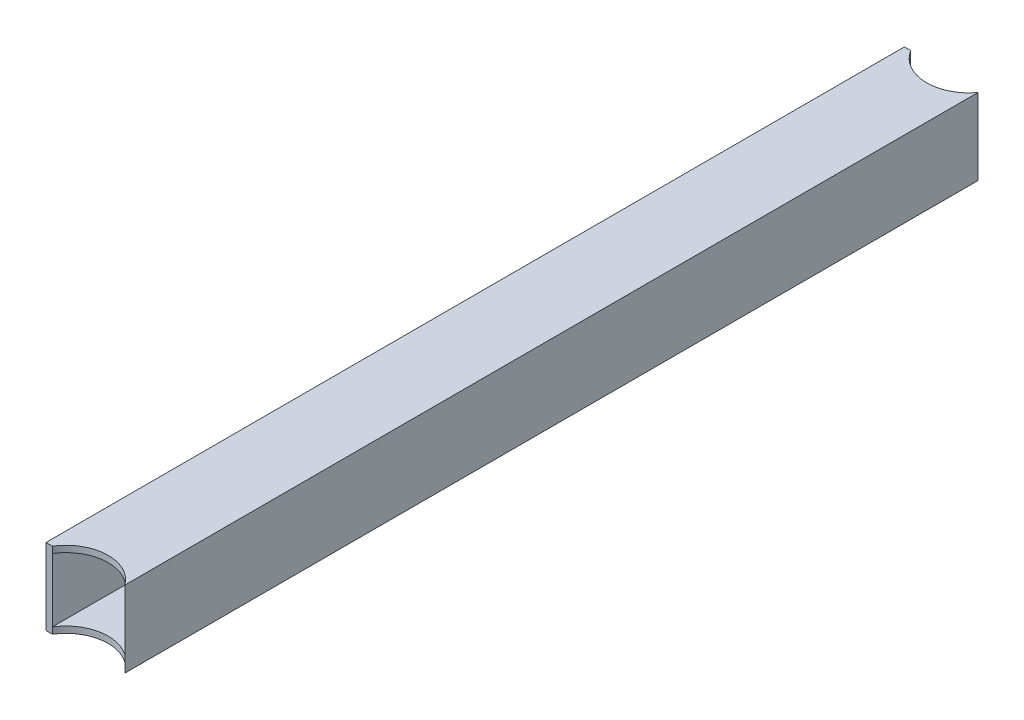
ISO-10303-21;
HEADER;
FILE_DESCRIPTION(('STEP AP214'),'2;1');
FILE_NAME('part.step','',(''),(''),'','','');
FILE_SCHEMA(('AUTOMOTIVE_DESIGN { 1 0 10303 214 1 1 1 1 }'));
ENDSEC;
DATA;
#1=APPLICATION_CONTEXT('core data for automotive mechanical design processes');
#2=APPLICATION_PROTOCOL_DEFINITION('international standard','automotive_design',2000,#1);
#3=PRODUCT_CONTEXT('',#1,'mechanical');
#4=PRODUCT('Part','Part','',(#3));
#5=PRODUCT_RELATED_PRODUCT_CATEGORY('part','',(#4));
#6=PRODUCT_DEFINITION_FORMATION('','',#4);
#7=PRODUCT_DEFINITION_CONTEXT('part definition',#1,'design');
#8=PRODUCT_DEFINITION('design','',#6,#7);
#9=PRODUCT_DEFINITION_SHAPE('','',#8);
#10=(LENGTH_UNIT() NAMED_UNIT(*) SI_UNIT(.MILLI.,.METRE.));
#11=(NAMED_UNIT(*) PLANE_ANGLE_UNIT() SI_UNIT($,.RADIAN.));
#12=(NAMED_UNIT(*) SI_UNIT($,.STERADIAN.) SOLID_ANGLE_UNIT());
#13=UNCERTAINTY_MEASURE_WITH_UNIT(LENGTH_MEASURE(1.E-05),#10,'distance_accuracy_value','');
#14=(GEOMETRIC_REPRESENTATION_CONTEXT(3) GLOBAL_UNCERTAINTY_ASSIGNED_CONTEXT((#13)) GLOBAL_UNIT_ASSIGNED_CONTEXT((#10,
#11,#12)) REPRESENTATION_CONTEXT('',''));
#15=CARTESIAN_POINT('',(0.,0.,0.));
#16=DIRECTION('',(0.,0.,1.));
#17=DIRECTION('',(1.,0.,0.));
#18=AXIS2_PLACEMENT_3D('',#15,#16,#17);
#19=CARTESIAN_POINT('',(21.082,0.,225.425));
#20=DIRECTION('',(0.,1.,0.));
#21=DIRECTION('',(0.,0.,1.));
#22=AXIS2_PLACEMENT_3D('',#19,#20,#21);
#23=CYLINDRICAL_SURFACE('',#22,21.082);
#24=DIRECTION('',(0.,1.,0.));
#25=VECTOR('',#24,1.);
#26=CARTESIAN_POINT('',(3.175,0.,214.298901177861));
#27=LINE('',#26,#25);
#28=CARTESIAN_POINT('',(3.175,3.175,214.298901177861));
#29=VERTEX_POINT('',#28);
#30=CARTESIAN_POINT('',(3.175,34.925,214.298901177861));
#31=VERTEX_POINT('',#30);
#32=EDGE_CURVE('E152',#29,#31,#27,.T.);
#33=ORIENTED_EDGE('',*,*,#32,.T.);
#34=CARTESIAN_POINT('',(21.082,34.925,225.425));
#35=DIRECTION('',(0.,-1.,0.));
#36=DIRECTION('',(0.,0.,-1.));
#37=AXIS2_PLACEMENT_3D('',#34,#35,#36);
#38=CIRCLE('',#37,21.082);
#39=CARTESIAN_POINT('',(34.925,34.925,209.524620287553));
#40=VERTEX_POINT('',#39);
#41=EDGE_CURVE('E11',#31,#40,#38,.T.);
#42=ORIENTED_EDGE('',*,*,#41,.T.);
#43=DIRECTION('',(0.,1.,0.));
#44=VECTOR('',#43,1.);
#45=CARTESIAN_POINT('',(34.925,0.,209.524620287553));
#46=LINE('',#45,#44);
#47=CARTESIAN_POINT('',(34.925,3.175,209.524620287553));
#48=VERTEX_POINT('',#47);
#49=EDGE_CURVE('E156',#40,#48,#46,.F.);
#50=ORIENTED_EDGE('',*,*,#49,.T.);
#51=CARTESIAN_POINT('',(21.082,3.175,225.425));
#52=DIRECTION('',(0.,1.,0.));
#53=DIRECTION('',(0.,0.,1.));
#54=AXIS2_PLACEMENT_3D('',#51,#52,#53);
#55=CIRCLE('',#54,21.082);
#56=EDGE_CURVE('E154',#48,#29,#55,.T.);
#57=ORIENTED_EDGE('',*,*,#56,.T.);
#58=EDGE_LOOP('',(#33,#42,#50,#57));
#59=FACE_BOUND('',#58,.T.);
#60=DIRECTION('',(0.,1.,0.));
#61=VECTOR('',#60,1.);
#62=CARTESIAN_POINT('',(3.16655784106908,0.,214.3125));
#63=LINE('',#62,#61);
#64=CARTESIAN_POINT('',(3.16655784106908,0.,214.3125));
#65=VERTEX_POINT('',#64);
#66=CARTESIAN_POINT('',(3.16655784106908,38.1,214.3125));
#67=VERTEX_POINT('',#66);
#68=EDGE_CURVE('E116',#65,#67,#63,.T.);
#69=ORIENTED_EDGE('',*,*,#68,.F.);
#70=CARTESIAN_POINT('',(21.082,0.,225.425));
#71=DIRECTION('',(0.,1.,0.));
#72=DIRECTION('',(0.,0.,1.));
#73=AXIS2_PLACEMENT_3D('',#70,#71,#72);
#74=CIRCLE('',#73,21.082);
#75=CARTESIAN_POINT('',(38.1,0.,212.981592106661));
#76=VERTEX_POINT('',#75);
#77=EDGE_CURVE('E124',#76,#65,#74,.T.);
#78=ORIENTED_EDGE('',*,*,#77,.F.);
#79=DIRECTION('',(0.,1.,0.));
#80=VECTOR('',#79,1.);
#81=CARTESIAN_POINT('',(38.1,0.,212.981592106661));
#82=LINE('',#81,#80);
#83=CARTESIAN_POINT('',(38.1,38.1,212.981592106661));
#84=VERTEX_POINT('',#83);
#85=EDGE_CURVE('E149',#84,#76,#82,.F.);
#86=ORIENTED_EDGE('',*,*,#85,.F.);
#87=CARTESIAN_POINT('',(21.082,38.1,225.425));
#88=DIRECTION('',(0.,1.,0.));
#89=DIRECTION('',(0.,0.,1.));
#90=AXIS2_PLACEMENT_3D('',#87,#88,#89);
#91=CIRCLE('',#90,21.082);
#92=EDGE_CURVE('E171',#84,#67,#91,.T.);
#93=ORIENTED_EDGE('',*,*,#92,.T.);
#94=EDGE_LOOP('',(#69,#78,#86,#93));
#95=FACE_BOUND('',#94,.T.);
#96=ADVANCED_FACE('F34',(#59,#95),#23,.F.);
#97=CARTESIAN_POINT('',(0.,38.1,762.));
#98=DIRECTION('',(0.,-1.,0.));
#99=DIRECTION('',(0.,0.,-1.));
#100=AXIS2_PLACEMENT_3D('',#97,#98,#99);
#101=PLANE('',#100);
#102=DIRECTION('',(1.,0.,0.));
#103=VECTOR('',#102,1.);
#104=CARTESIAN_POINT('',(0.,38.1,214.3125));
#105=LINE('',#104,#103);
#106=CARTESIAN_POINT('',(0.,38.1,214.3125));
#107=VERTEX_POINT('',#106);
#108=EDGE_CURVE('E49',#107,#67,#105,.T.);
#109=ORIENTED_EDGE('',*,*,#108,.T.);
#110=ORIENTED_EDGE('',*,*,#92,.F.);
#111=DIRECTION('',(0.,0.,-1.));
#112=VECTOR('',#111,1.);
#113=CARTESIAN_POINT('',(38.1,38.1,762.));
#114=LINE('',#113,#112);
#115=CARTESIAN_POINT('',(38.1,38.1,-212.981592106662));
#116=VERTEX_POINT('',#115);
#117=EDGE_CURVE('E130',#84,#116,#114,.T.);
#118=ORIENTED_EDGE('',*,*,#117,.T.);
#119=CARTESIAN_POINT('',(21.0819999999999,38.1,-225.425));
#120=DIRECTION('',(0.,1.,0.));
#121=DIRECTION('',(0.,0.,-1.));
#122=AXIS2_PLACEMENT_3D('',#119,#120,#121);
#123=CIRCLE('',#122,21.082);
#124=CARTESIAN_POINT('',(3.16655784106902,38.1,-214.3125));
#125=VERTEX_POINT('',#124);
#126=EDGE_CURVE('E167',#125,#116,#123,.T.);
#127=ORIENTED_EDGE('',*,*,#126,.F.);
#128=DIRECTION('',(1.,0.,0.));
#129=VECTOR('',#128,1.);
#130=CARTESIAN_POINT('',(0.,38.1,-214.3125));
#131=LINE('',#130,#129);
#132=CARTESIAN_POINT('',(0.,38.1,-214.3125));
#133=VERTEX_POINT('',#132);
#134=EDGE_CURVE('E179',#133,#125,#131,.T.);
#135=ORIENTED_EDGE('',*,*,#134,.F.);
#136=DIRECTION('',(0.,0.,-1.));
#137=VECTOR('',#136,1.);
#138=CARTESIAN_POINT('',(0.,38.1,762.));
#139=LINE('',#138,#137);
#140=EDGE_CURVE('E135',#107,#133,#139,.T.);
#141=ORIENTED_EDGE('',*,*,#140,.F.);
#142=EDGE_LOOP('',(#109,#110,#118,#127,#135,#141));
#143=FACE_BOUND('',#142,.T.);
#144=ADVANCED_FACE('F185',(#143),#101,.F.);
#145=CARTESIAN_POINT('',(0.,0.,762.));
#146=DIRECTION('',(0.,1.,0.));
#147=DIRECTION('',(0.,0.,1.));
#148=AXIS2_PLACEMENT_3D('',#145,#146,#147);
#149=PLANE('',#148);
#150=DIRECTION('',(1.,0.,0.));
#151=VECTOR('',#150,1.);
#152=CARTESIAN_POINT('',(0.,0.,214.3125));
#153=LINE('',#152,#151);
#154=CARTESIAN_POINT('',(0.,0.,214.3125));
#155=VERTEX_POINT('',#154);
#156=EDGE_CURVE('E110',#155,#65,#153,.T.);
#157=ORIENTED_EDGE('',*,*,#156,.F.);
#158=DIRECTION('',(0.,0.,-1.));
#159=VECTOR('',#158,1.);
#160=CARTESIAN_POINT('',(0.,0.,762.));
#161=LINE('',#160,#159);
#162=CARTESIAN_POINT('',(0.,0.,-214.3125));
#163=VERTEX_POINT('',#162);
#164=EDGE_CURVE('E122',#155,#163,#161,.T.);
#165=ORIENTED_EDGE('',*,*,#164,.T.);
#166=DIRECTION('',(1.,0.,0.));
#167=VECTOR('',#166,1.);
#168=CARTESIAN_POINT('',(0.,0.,-214.3125));
#169=LINE('',#168,#167);
#170=CARTESIAN_POINT('',(3.16655784106902,0.,-214.3125));
#171=VERTEX_POINT('',#170);
#172=EDGE_CURVE('E57',#163,#171,#169,.T.);
#173=ORIENTED_EDGE('',*,*,#172,.T.);
#174=CARTESIAN_POINT('',(21.0819999999999,0.,-225.425));
#175=DIRECTION('',(0.,1.,0.));
#176=DIRECTION('',(0.,0.,-1.));
#177=AXIS2_PLACEMENT_3D('',#174,#175,#176);
#178=CIRCLE('',#177,21.082);
#179=CARTESIAN_POINT('',(38.1,0.,-212.981592106662));
#180=VERTEX_POINT('',#179);
#181=EDGE_CURVE('E169',#171,#180,#178,.T.);
#182=ORIENTED_EDGE('',*,*,#181,.T.);
#183=DIRECTION('',(0.,0.,-1.));
#184=VECTOR('',#183,1.);
#185=CARTESIAN_POINT('',(38.1,0.,762.));
#186=LINE('',#185,#184);
#187=EDGE_CURVE('E127',#76,#180,#186,.T.);
#188=ORIENTED_EDGE('',*,*,#187,.F.);
#189=ORIENTED_EDGE('',*,*,#77,.T.);
#190=EDGE_LOOP('',(#157,#165,#173,#182,#188,#189));
#191=FACE_BOUND('',#190,.T.);
#192=ADVANCED_FACE('F121',(#191),#149,.F.);
#193=CARTESIAN_POINT('',(0.,0.,762.));
#194=DIRECTION('',(1.,0.,0.));
#195=DIRECTION('',(0.,0.,-1.));
#196=AXIS2_PLACEMENT_3D('',#193,#194,#195);
#197=PLANE('',#196);
#198=DIRECTION('',(0.,1.,0.));
#199=VECTOR('',#198,1.);
#200=CARTESIAN_POINT('',(0.,0.,214.3125));
#201=LINE('',#200,#199);
#202=EDGE_CURVE('E107',#155,#107,#201,.T.);
#203=ORIENTED_EDGE('',*,*,#202,.T.);
#204=ORIENTED_EDGE('',*,*,#140,.T.);
#205=DIRECTION('',(0.,1.,0.));
#206=VECTOR('',#205,1.);
#207=CARTESIAN_POINT('',(0.,0.,-214.3125));
#208=LINE('',#207,#206);
#209=EDGE_CURVE('E126',#163,#133,#208,.T.);
#210=ORIENTED_EDGE('',*,*,#209,.F.);
#211=ORIENTED_EDGE('',*,*,#164,.F.);
#212=EDGE_LOOP('',(#203,#204,#210,#211));
#213=FACE_BOUND('',#212,.T.);
#214=ADVANCED_FACE('F36',(#213),#197,.F.);
#215=CARTESIAN_POINT('',(3.175,34.925,762.));
#216=DIRECTION('',(0.,-1.,0.));
#217=DIRECTION('',(0.,0.,-1.));
#218=AXIS2_PLACEMENT_3D('',#215,#216,#217);
#219=PLANE('',#218);
#220=ORIENTED_EDGE('',*,*,#41,.F.);
#221=DIRECTION('',(0.,0.,-1.));
#222=VECTOR('',#221,1.);
#223=CARTESIAN_POINT('',(3.175,34.925,762.));
#224=LINE('',#223,#222);
#225=CARTESIAN_POINT('',(3.175,34.925,-214.298901177861));
#226=VERTEX_POINT('',#225);
#227=EDGE_CURVE('E146',#31,#226,#224,.T.);
#228=ORIENTED_EDGE('',*,*,#227,.T.);
#229=CARTESIAN_POINT('',(21.0819999999999,34.925,-225.425));
#230=DIRECTION('',(0.,-1.,0.));
#231=DIRECTION('',(0.,0.,-1.));
#232=AXIS2_PLACEMENT_3D('',#229,#230,#231);
#233=CIRCLE('',#232,21.082);
#234=CARTESIAN_POINT('',(34.925,34.925,-209.524620287553));
#235=VERTEX_POINT('',#234);
#236=EDGE_CURVE('E42',#235,#226,#233,.T.);
#237=ORIENTED_EDGE('',*,*,#236,.F.);
#238=DIRECTION('',(0.,0.,-1.));
#239=VECTOR('',#238,1.);
#240=CARTESIAN_POINT('',(34.925,34.925,762.));
#241=LINE('',#240,#239);
#242=EDGE_CURVE('E143',#40,#235,#241,.T.);
#243=ORIENTED_EDGE('',*,*,#242,.F.);
#244=EDGE_LOOP('',(#220,#228,#237,#243));
#245=FACE_BOUND('',#244,.T.);
#246=ADVANCED_FACE('F217',(#245),#219,.T.);
#247=CARTESIAN_POINT('',(34.925,3.175,762.));
#248=DIRECTION('',(-1.,0.,0.));
#249=DIRECTION('',(0.,0.,1.));
#250=AXIS2_PLACEMENT_3D('',#247,#248,#249);
#251=PLANE('',#250);
#252=ORIENTED_EDGE('',*,*,#49,.F.);
#253=ORIENTED_EDGE('',*,*,#242,.T.);
#254=DIRECTION('',(0.,1.,0.));
#255=VECTOR('',#254,1.);
#256=CARTESIAN_POINT('',(34.925,0.,-209.524620287553));
#257=LINE('',#256,#255);
#258=CARTESIAN_POINT('',(34.925,3.175,-209.524620287553));
#259=VERTEX_POINT('',#258);
#260=EDGE_CURVE('E164',#259,#235,#257,.T.);
#261=ORIENTED_EDGE('',*,*,#260,.F.);
#262=DIRECTION('',(0.,0.,-1.));
#263=VECTOR('',#262,1.);
#264=CARTESIAN_POINT('',(34.925,3.175,762.));
#265=LINE('',#264,#263);
#266=EDGE_CURVE('E140',#48,#259,#265,.T.);
#267=ORIENTED_EDGE('',*,*,#266,.F.);
#268=EDGE_LOOP('',(#252,#253,#261,#267));
#269=FACE_BOUND('',#268,.T.);
#270=ADVANCED_FACE('F220',(#269),#251,.T.);
#271=CARTESIAN_POINT('',(3.175,3.175,762.));
#272=DIRECTION('',(0.,1.,0.));
#273=DIRECTION('',(0.,0.,1.));
#274=AXIS2_PLACEMENT_3D('',#271,#272,#273);
#275=PLANE('',#274);
#276=ORIENTED_EDGE('',*,*,#56,.F.);
#277=ORIENTED_EDGE('',*,*,#266,.T.);
#278=CARTESIAN_POINT('',(21.0819999999999,3.175,-225.425));
#279=DIRECTION('',(0.,1.,0.));
#280=DIRECTION('',(0.,0.,1.));
#281=AXIS2_PLACEMENT_3D('',#278,#279,#280);
#282=CIRCLE('',#281,21.082);
#283=CARTESIAN_POINT('',(3.175,3.175,-214.298901177861));
#284=VERTEX_POINT('',#283);
#285=EDGE_CURVE('E163',#284,#259,#282,.T.);
#286=ORIENTED_EDGE('',*,*,#285,.F.);
#287=DIRECTION('',(0.,0.,-1.));
#288=VECTOR('',#287,1.);
#289=CARTESIAN_POINT('',(3.175,3.175,762.));
#290=LINE('',#289,#288);
#291=EDGE_CURVE('E137',#29,#284,#290,.T.);
#292=ORIENTED_EDGE('',*,*,#291,.F.);
#293=EDGE_LOOP('',(#276,#277,#286,#292));
#294=FACE_BOUND('',#293,.T.);
#295=ADVANCED_FACE('F224',(#294),#275,.T.);
#296=CARTESIAN_POINT('',(3.175,3.175,762.));
#297=DIRECTION('',(1.,0.,0.));
#298=DIRECTION('',(0.,0.,-1.));
#299=AXIS2_PLACEMENT_3D('',#296,#297,#298);
#300=PLANE('',#299);
#301=ORIENTED_EDGE('',*,*,#32,.F.);
#302=ORIENTED_EDGE('',*,*,#291,.T.);
#303=DIRECTION('',(0.,1.,0.));
#304=VECTOR('',#303,1.);
#305=CARTESIAN_POINT('',(3.175,0.,-214.298901177861));
#306=LINE('',#305,#304);
#307=EDGE_CURVE('E161',#226,#284,#306,.F.);
#308=ORIENTED_EDGE('',*,*,#307,.F.);
#309=ORIENTED_EDGE('',*,*,#227,.F.);
#310=EDGE_LOOP('',(#301,#302,#308,#309));
#311=FACE_BOUND('',#310,.T.);
#312=ADVANCED_FACE('F216',(#311),#300,.T.);
#313=CARTESIAN_POINT('',(21.0819999999999,0.,-225.425));
#314=DIRECTION('',(0.,1.,0.));
#315=DIRECTION('',(0.,0.,1.));
#316=AXIS2_PLACEMENT_3D('',#313,#314,#315);
#317=CYLINDRICAL_SURFACE('',#316,21.082);
#318=ORIENTED_EDGE('',*,*,#181,.F.);
#319=DIRECTION('',(0.,1.,0.));
#320=VECTOR('',#319,1.);
#321=CARTESIAN_POINT('',(3.16655784106902,0.,-214.3125));
#322=LINE('',#321,#320);
#323=EDGE_CURVE('E176',#171,#125,#322,.T.);
#324=ORIENTED_EDGE('',*,*,#323,.T.);
#325=ORIENTED_EDGE('',*,*,#126,.T.);
#326=DIRECTION('',(0.,1.,0.));
#327=VECTOR('',#326,1.);
#328=CARTESIAN_POINT('',(38.1,0.,-212.981592106662));
#329=LINE('',#328,#327);
#330=EDGE_CURVE('E158',#180,#116,#329,.T.);
#331=ORIENTED_EDGE('',*,*,#330,.F.);
#332=EDGE_LOOP('',(#318,#324,#325,#331));
#333=FACE_BOUND('',#332,.T.);
#334=ORIENTED_EDGE('',*,*,#307,.T.);
#335=ORIENTED_EDGE('',*,*,#285,.T.);
#336=ORIENTED_EDGE('',*,*,#260,.T.);
#337=ORIENTED_EDGE('',*,*,#236,.T.);
#338=EDGE_LOOP('',(#334,#335,#336,#337));
#339=FACE_BOUND('',#338,.T.);
#340=ADVANCED_FACE('F194',(#333,#339),#317,.F.);
#341=CARTESIAN_POINT('',(38.1,0.,762.));
#342=DIRECTION('',(-1.,0.,0.));
#343=DIRECTION('',(0.,0.,1.));
#344=AXIS2_PLACEMENT_3D('',#341,#342,#343);
#345=PLANE('',#344);
#346=ORIENTED_EDGE('',*,*,#117,.F.);
#347=ORIENTED_EDGE('',*,*,#85,.T.);
#348=ORIENTED_EDGE('',*,*,#187,.T.);
#349=ORIENTED_EDGE('',*,*,#330,.T.);
#350=EDGE_LOOP('',(#346,#347,#348,#349));
#351=FACE_BOUND('',#350,.T.);
#352=ADVANCED_FACE('F190',(#351),#345,.F.);
#353=CARTESIAN_POINT('',(0.,0.,-214.3125));
#354=DIRECTION('',(0.,0.,1.));
#355=DIRECTION('',(1.,0.,0.));
#356=AXIS2_PLACEMENT_3D('',#353,#354,#355);
#357=PLANE('',#356);
#358=ORIENTED_EDGE('',*,*,#134,.T.);
#359=ORIENTED_EDGE('',*,*,#323,.F.);
#360=ORIENTED_EDGE('',*,*,#172,.F.);
#361=ORIENTED_EDGE('',*,*,#209,.T.);
#362=EDGE_LOOP('',(#358,#359,#360,#361));
#363=FACE_BOUND('',#362,.T.);
#364=ADVANCED_FACE('F197',(#363),#357,.F.);
#365=CARTESIAN_POINT('',(0.,0.,214.3125));
#366=DIRECTION('',(0.,0.,1.));
#367=DIRECTION('',(1.,0.,0.));
#368=AXIS2_PLACEMENT_3D('',#365,#366,#367);
#369=PLANE('',#368);
#370=ORIENTED_EDGE('',*,*,#108,.F.);
#371=ORIENTED_EDGE('',*,*,#202,.F.);
#372=ORIENTED_EDGE('',*,*,#156,.T.);
#373=ORIENTED_EDGE('',*,*,#68,.T.);
#374=EDGE_LOOP('',(#370,#371,#372,#373));
#375=FACE_BOUND('',#374,.T.);
#376=ADVANCED_FACE('F109',(#375),#369,.T.);
#377=CLOSED_SHELL('',(#96,#144,#192,#214,#246,#270,#295,#312,#340,#352,#364,#376));
#378=MANIFOLD_SOLID_BREP('B2',#377);
#379=ADVANCED_BREP_SHAPE_REPRESENTATION('',(#18,#378),#14);
#380=SHAPE_DEFINITION_REPRESENTATION(#9,#379);
ENDSEC;
END-ISO-10303-21;
